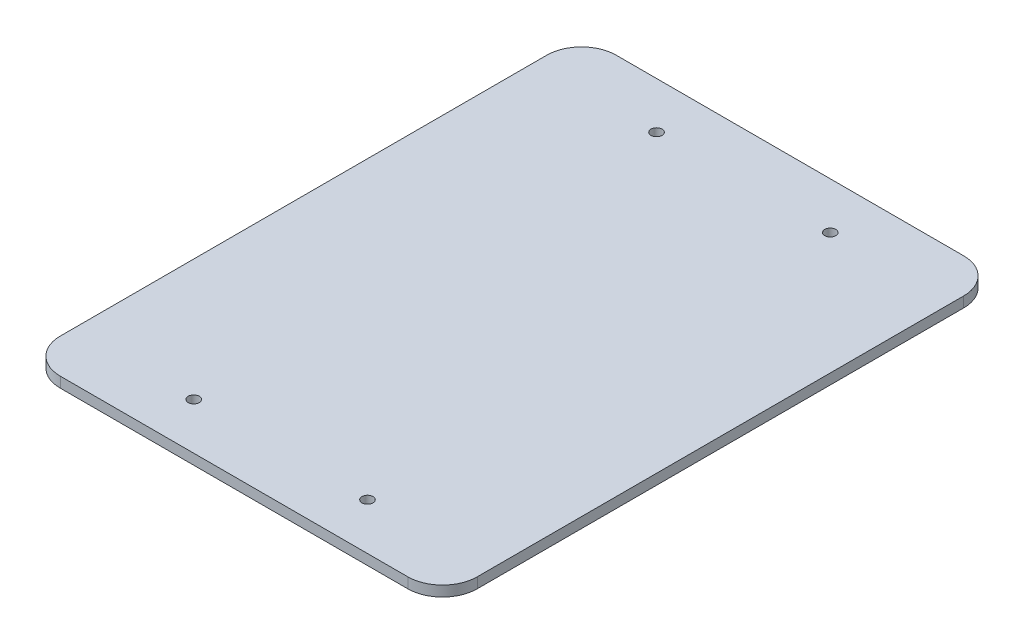
ISO-10303-21;
HEADER;
FILE_DESCRIPTION(('STEP AP214'),'2;1');
FILE_NAME('part.step','',(''),(''),'','','');
FILE_SCHEMA(('AUTOMOTIVE_DESIGN { 1 0 10303 214 1 1 1 1 }'));
ENDSEC;
DATA;
#1=APPLICATION_CONTEXT('core data for automotive mechanical design processes');
#2=APPLICATION_PROTOCOL_DEFINITION('international standard','automotive_design',2000,#1);
#3=PRODUCT_CONTEXT('',#1,'mechanical');
#4=PRODUCT('Part','Part','',(#3));
#5=PRODUCT_RELATED_PRODUCT_CATEGORY('part','',(#4));
#6=PRODUCT_DEFINITION_FORMATION('','',#4);
#7=PRODUCT_DEFINITION_CONTEXT('part definition',#1,'design');
#8=PRODUCT_DEFINITION('design','',#6,#7);
#9=PRODUCT_DEFINITION_SHAPE('','',#8);
#10=(LENGTH_UNIT() NAMED_UNIT(*) SI_UNIT(.MILLI.,.METRE.));
#11=(NAMED_UNIT(*) PLANE_ANGLE_UNIT() SI_UNIT($,.RADIAN.));
#12=(NAMED_UNIT(*) SI_UNIT($,.STERADIAN.) SOLID_ANGLE_UNIT());
#13=UNCERTAINTY_MEASURE_WITH_UNIT(LENGTH_MEASURE(1.E-05),#10,'distance_accuracy_value','');
#14=(GEOMETRIC_REPRESENTATION_CONTEXT(3) GLOBAL_UNCERTAINTY_ASSIGNED_CONTEXT((#13)) GLOBAL_UNIT_ASSIGNED_CONTEXT((#10,
#11,#12)) REPRESENTATION_CONTEXT('',''));
#15=CARTESIAN_POINT('',(0.,0.,0.));
#16=DIRECTION('',(0.,0.,1.));
#17=DIRECTION('',(1.,0.,0.));
#18=AXIS2_PLACEMENT_3D('',#15,#16,#17);
#19=CARTESIAN_POINT('',(110.,3.,-10.));
#20=DIRECTION('',(0.,-1.,0.));
#21=DIRECTION('',(0.,0.,-1.));
#22=AXIS2_PLACEMENT_3D('',#19,#20,#21);
#23=CYLINDRICAL_SURFACE('',#22,10.);
#24=CARTESIAN_POINT('',(110.,0.,-10.));
#25=DIRECTION('',(0.,1.,0.));
#26=DIRECTION('',(0.,0.,1.));
#27=AXIS2_PLACEMENT_3D('',#24,#25,#26);
#28=CIRCLE('',#27,10.);
#29=CARTESIAN_POINT('',(110.,0.,0.));
#30=VERTEX_POINT('',#29);
#31=CARTESIAN_POINT('',(120.,0.,-10.));
#32=VERTEX_POINT('',#31);
#33=EDGE_CURVE('E134',#30,#32,#28,.T.);
#34=ORIENTED_EDGE('',*,*,#33,.T.);
#35=DIRECTION('',(0.,-1.,0.));
#36=VECTOR('',#35,1.);
#37=CARTESIAN_POINT('',(120.,3.,-10.));
#38=LINE('',#37,#36);
#39=CARTESIAN_POINT('',(120.,3.,-10.));
#40=VERTEX_POINT('',#39);
#41=EDGE_CURVE('E11',#40,#32,#38,.T.);
#42=ORIENTED_EDGE('',*,*,#41,.F.);
#43=CARTESIAN_POINT('',(110.,3.,-10.));
#44=DIRECTION('',(0.,1.,0.));
#45=DIRECTION('',(0.,0.,1.));
#46=AXIS2_PLACEMENT_3D('',#43,#44,#45);
#47=CIRCLE('',#46,10.);
#48=CARTESIAN_POINT('',(110.,3.,0.));
#49=VERTEX_POINT('',#48);
#50=EDGE_CURVE('E148',#49,#40,#47,.T.);
#51=ORIENTED_EDGE('',*,*,#50,.F.);
#52=DIRECTION('',(0.,-1.,0.));
#53=VECTOR('',#52,1.);
#54=CARTESIAN_POINT('',(110.,3.,0.));
#55=LINE('',#54,#53);
#56=EDGE_CURVE('E130',#49,#30,#55,.T.);
#57=ORIENTED_EDGE('',*,*,#56,.T.);
#58=EDGE_LOOP('',(#34,#42,#51,#57));
#59=FACE_BOUND('',#58,.T.);
#60=ADVANCED_FACE('F36',(#59),#23,.T.);
#61=CARTESIAN_POINT('',(120.,3.,-10.));
#62=DIRECTION('',(-1.,0.,0.));
#63=DIRECTION('',(0.,0.,1.));
#64=AXIS2_PLACEMENT_3D('',#61,#62,#63);
#65=PLANE('',#64);
#66=DIRECTION('',(0.,0.,-1.));
#67=VECTOR('',#66,1.);
#68=CARTESIAN_POINT('',(120.,0.,-10.));
#69=LINE('',#68,#67);
#70=CARTESIAN_POINT('',(120.,0.,-150.));
#71=VERTEX_POINT('',#70);
#72=EDGE_CURVE('E137',#32,#71,#69,.T.);
#73=ORIENTED_EDGE('',*,*,#72,.T.);
#74=DIRECTION('',(0.,-1.,0.));
#75=VECTOR('',#74,1.);
#76=CARTESIAN_POINT('',(120.,3.,-150.));
#77=LINE('',#76,#75);
#78=CARTESIAN_POINT('',(120.,3.,-150.));
#79=VERTEX_POINT('',#78);
#80=EDGE_CURVE('E45',#79,#71,#77,.T.);
#81=ORIENTED_EDGE('',*,*,#80,.F.);
#82=DIRECTION('',(0.,0.,-1.));
#83=VECTOR('',#82,1.);
#84=CARTESIAN_POINT('',(120.,3.,-10.));
#85=LINE('',#84,#83);
#86=EDGE_CURVE('E97',#40,#79,#85,.T.);
#87=ORIENTED_EDGE('',*,*,#86,.F.);
#88=ORIENTED_EDGE('',*,*,#41,.T.);
#89=EDGE_LOOP('',(#73,#81,#87,#88));
#90=FACE_BOUND('',#89,.T.);
#91=ADVANCED_FACE('F189',(#90),#65,.F.);
#92=CARTESIAN_POINT('',(110.,3.,-150.));
#93=DIRECTION('',(0.,-1.,0.));
#94=DIRECTION('',(0.,0.,-1.));
#95=AXIS2_PLACEMENT_3D('',#92,#93,#94);
#96=CYLINDRICAL_SURFACE('',#95,10.);
#97=CARTESIAN_POINT('',(110.,0.,-150.));
#98=DIRECTION('',(0.,1.,0.));
#99=DIRECTION('',(0.,0.,-1.));
#100=AXIS2_PLACEMENT_3D('',#97,#98,#99);
#101=CIRCLE('',#100,10.);
#102=CARTESIAN_POINT('',(110.,0.,-160.));
#103=VERTEX_POINT('',#102);
#104=EDGE_CURVE('E139',#71,#103,#101,.T.);
#105=ORIENTED_EDGE('',*,*,#104,.T.);
#106=DIRECTION('',(0.,-1.,0.));
#107=VECTOR('',#106,1.);
#108=CARTESIAN_POINT('',(110.,3.,-160.));
#109=LINE('',#108,#107);
#110=CARTESIAN_POINT('',(110.,3.,-160.));
#111=VERTEX_POINT('',#110);
#112=EDGE_CURVE('E155',#111,#103,#109,.T.);
#113=ORIENTED_EDGE('',*,*,#112,.F.);
#114=CARTESIAN_POINT('',(110.,3.,-150.));
#115=DIRECTION('',(0.,1.,0.));
#116=DIRECTION('',(0.,0.,-1.));
#117=AXIS2_PLACEMENT_3D('',#114,#115,#116);
#118=CIRCLE('',#117,10.);
#119=EDGE_CURVE('E204',#79,#111,#118,.T.);
#120=ORIENTED_EDGE('',*,*,#119,.F.);
#121=ORIENTED_EDGE('',*,*,#80,.T.);
#122=EDGE_LOOP('',(#105,#113,#120,#121));
#123=FACE_BOUND('',#122,.T.);
#124=ADVANCED_FACE('F194',(#123),#96,.T.);
#125=CARTESIAN_POINT('',(10.,3.,-160.));
#126=DIRECTION('',(0.,0.,1.));
#127=DIRECTION('',(1.,0.,0.));
#128=AXIS2_PLACEMENT_3D('',#125,#126,#127);
#129=PLANE('',#128);
#130=DIRECTION('',(-1.,0.,0.));
#131=VECTOR('',#130,1.);
#132=CARTESIAN_POINT('',(10.,0.,-160.));
#133=LINE('',#132,#131);
#134=CARTESIAN_POINT('',(10.,0.,-160.));
#135=VERTEX_POINT('',#134);
#136=EDGE_CURVE('E141',#103,#135,#133,.T.);
#137=ORIENTED_EDGE('',*,*,#136,.T.);
#138=DIRECTION('',(0.,-1.,0.));
#139=VECTOR('',#138,1.);
#140=CARTESIAN_POINT('',(10.,3.,-160.));
#141=LINE('',#140,#139);
#142=CARTESIAN_POINT('',(10.,3.,-160.));
#143=VERTEX_POINT('',#142);
#144=EDGE_CURVE('E152',#143,#135,#141,.T.);
#145=ORIENTED_EDGE('',*,*,#144,.F.);
#146=DIRECTION('',(-1.,0.,0.));
#147=VECTOR('',#146,1.);
#148=CARTESIAN_POINT('',(10.,3.,-160.));
#149=LINE('',#148,#147);
#150=EDGE_CURVE('E206',#111,#143,#149,.T.);
#151=ORIENTED_EDGE('',*,*,#150,.F.);
#152=ORIENTED_EDGE('',*,*,#112,.T.);
#153=EDGE_LOOP('',(#137,#145,#151,#152));
#154=FACE_BOUND('',#153,.T.);
#155=ADVANCED_FACE('F253',(#154),#129,.F.);
#156=CARTESIAN_POINT('',(10.,3.,-150.));
#157=DIRECTION('',(0.,-1.,0.));
#158=DIRECTION('',(0.,0.,-1.));
#159=AXIS2_PLACEMENT_3D('',#156,#157,#158);
#160=CYLINDRICAL_SURFACE('',#159,10.);
#161=CARTESIAN_POINT('',(10.,0.,-150.));
#162=DIRECTION('',(0.,1.,0.));
#163=DIRECTION('',(0.,0.,-1.));
#164=AXIS2_PLACEMENT_3D('',#161,#162,#163);
#165=CIRCLE('',#164,10.);
#166=CARTESIAN_POINT('',(0.,0.,-150.));
#167=VERTEX_POINT('',#166);
#168=EDGE_CURVE('E143',#135,#167,#165,.T.);
#169=ORIENTED_EDGE('',*,*,#168,.T.);
#170=DIRECTION('',(0.,-1.,0.));
#171=VECTOR('',#170,1.);
#172=CARTESIAN_POINT('',(0.,3.,-150.));
#173=LINE('',#172,#171);
#174=CARTESIAN_POINT('',(0.,3.,-150.));
#175=VERTEX_POINT('',#174);
#176=EDGE_CURVE('E125',#175,#167,#173,.T.);
#177=ORIENTED_EDGE('',*,*,#176,.F.);
#178=CARTESIAN_POINT('',(10.,3.,-150.));
#179=DIRECTION('',(0.,1.,0.));
#180=DIRECTION('',(0.,0.,-1.));
#181=AXIS2_PLACEMENT_3D('',#178,#179,#180);
#182=CIRCLE('',#181,10.);
#183=EDGE_CURVE('E116',#143,#175,#182,.T.);
#184=ORIENTED_EDGE('',*,*,#183,.F.);
#185=ORIENTED_EDGE('',*,*,#144,.T.);
#186=EDGE_LOOP('',(#169,#177,#184,#185));
#187=FACE_BOUND('',#186,.T.);
#188=ADVANCED_FACE('F250',(#187),#160,.T.);
#189=CARTESIAN_POINT('',(0.,3.,-10.0000000000001));
#190=DIRECTION('',(1.,0.,0.));
#191=DIRECTION('',(0.,0.,-1.));
#192=AXIS2_PLACEMENT_3D('',#189,#190,#191);
#193=PLANE('',#192);
#194=DIRECTION('',(0.,0.,1.));
#195=VECTOR('',#194,1.);
#196=CARTESIAN_POINT('',(0.,0.,-10.0000000000001));
#197=LINE('',#196,#195);
#198=CARTESIAN_POINT('',(0.,0.,-10.0000000000001));
#199=VERTEX_POINT('',#198);
#200=EDGE_CURVE('E124',#167,#199,#197,.T.);
#201=ORIENTED_EDGE('',*,*,#200,.T.);
#202=DIRECTION('',(0.,-1.,0.));
#203=VECTOR('',#202,1.);
#204=CARTESIAN_POINT('',(0.,3.,-10.0000000000001));
#205=LINE('',#204,#203);
#206=CARTESIAN_POINT('',(0.,3.,-10.0000000000001));
#207=VERTEX_POINT('',#206);
#208=EDGE_CURVE('E121',#207,#199,#205,.T.);
#209=ORIENTED_EDGE('',*,*,#208,.F.);
#210=DIRECTION('',(0.,0.,1.));
#211=VECTOR('',#210,1.);
#212=CARTESIAN_POINT('',(0.,3.,-10.0000000000001));
#213=LINE('',#212,#211);
#214=EDGE_CURVE('E110',#175,#207,#213,.T.);
#215=ORIENTED_EDGE('',*,*,#214,.F.);
#216=ORIENTED_EDGE('',*,*,#176,.T.);
#217=EDGE_LOOP('',(#201,#209,#215,#216));
#218=FACE_BOUND('',#217,.T.);
#219=ADVANCED_FACE('F122',(#218),#193,.F.);
#220=CARTESIAN_POINT('',(10.,3.,-10.));
#221=DIRECTION('',(0.,-1.,0.));
#222=DIRECTION('',(0.,0.,-1.));
#223=AXIS2_PLACEMENT_3D('',#220,#221,#222);
#224=CYLINDRICAL_SURFACE('',#223,10.);
#225=CARTESIAN_POINT('',(10.,0.,-10.));
#226=DIRECTION('',(0.,1.,0.));
#227=DIRECTION('',(0.,0.,-1.));
#228=AXIS2_PLACEMENT_3D('',#225,#226,#227);
#229=CIRCLE('',#228,10.);
#230=CARTESIAN_POINT('',(10.0000000000001,0.,0.));
#231=VERTEX_POINT('',#230);
#232=EDGE_CURVE('E83',#199,#231,#229,.T.);
#233=ORIENTED_EDGE('',*,*,#232,.T.);
#234=DIRECTION('',(0.,-1.,0.));
#235=VECTOR('',#234,1.);
#236=CARTESIAN_POINT('',(10.0000000000001,3.,0.));
#237=LINE('',#236,#235);
#238=CARTESIAN_POINT('',(10.0000000000001,3.,0.));
#239=VERTEX_POINT('',#238);
#240=EDGE_CURVE('E126',#239,#231,#237,.T.);
#241=ORIENTED_EDGE('',*,*,#240,.F.);
#242=CARTESIAN_POINT('',(10.,3.,-10.));
#243=DIRECTION('',(0.,1.,0.));
#244=DIRECTION('',(0.,0.,-1.));
#245=AXIS2_PLACEMENT_3D('',#242,#243,#244);
#246=CIRCLE('',#245,10.);
#247=EDGE_CURVE('E114',#207,#239,#246,.T.);
#248=ORIENTED_EDGE('',*,*,#247,.F.);
#249=ORIENTED_EDGE('',*,*,#208,.T.);
#250=EDGE_LOOP('',(#233,#241,#248,#249));
#251=FACE_BOUND('',#250,.T.);
#252=ADVANCED_FACE('F128',(#251),#224,.T.);
#253=CARTESIAN_POINT('',(10.0000000000001,3.,0.));
#254=DIRECTION('',(0.,0.,-1.));
#255=DIRECTION('',(-1.,0.,0.));
#256=AXIS2_PLACEMENT_3D('',#253,#254,#255);
#257=PLANE('',#256);
#258=DIRECTION('',(1.,0.,0.));
#259=VECTOR('',#258,1.);
#260=CARTESIAN_POINT('',(10.0000000000001,0.,0.));
#261=LINE('',#260,#259);
#262=EDGE_CURVE('E89',#231,#30,#261,.T.);
#263=ORIENTED_EDGE('',*,*,#262,.T.);
#264=ORIENTED_EDGE('',*,*,#56,.F.);
#265=DIRECTION('',(1.,0.,0.));
#266=VECTOR('',#265,1.);
#267=CARTESIAN_POINT('',(10.0000000000001,3.,0.));
#268=LINE('',#267,#266);
#269=EDGE_CURVE('E54',#239,#49,#268,.T.);
#270=ORIENTED_EDGE('',*,*,#269,.F.);
#271=ORIENTED_EDGE('',*,*,#240,.T.);
#272=EDGE_LOOP('',(#263,#264,#270,#271));
#273=FACE_BOUND('',#272,.T.);
#274=ADVANCED_FACE('F227',(#273),#257,.F.);
#275=CARTESIAN_POINT('',(110.,3.,-10.));
#276=DIRECTION('',(0.,1.,0.));
#277=DIRECTION('',(0.,0.,1.));
#278=AXIS2_PLACEMENT_3D('',#275,#276,#277);
#279=PLANE('',#278);
#280=CARTESIAN_POINT('',(85.,3.,-146.59));
#281=DIRECTION('',(0.,1.,0.));
#282=DIRECTION('',(0.,0.,1.));
#283=AXIS2_PLACEMENT_3D('',#280,#281,#282);
#284=CIRCLE('',#283,1.58749999999999);
#285=CARTESIAN_POINT('',(85.,3.,-145.0025));
#286=VERTEX_POINT('',#285);
#287=EDGE_CURVE('E214',#286,#286,#284,.T.);
#288=ORIENTED_EDGE('',*,*,#287,.F.);
#289=EDGE_LOOP('',(#288));
#290=FACE_BOUND('',#289,.T.);
#291=CARTESIAN_POINT('',(35.,3.,-13.41));
#292=DIRECTION('',(0.,1.,0.));
#293=DIRECTION('',(0.,0.,1.));
#294=AXIS2_PLACEMENT_3D('',#291,#292,#293);
#295=CIRCLE('',#294,1.5875);
#296=CARTESIAN_POINT('',(35.,3.,-11.8225));
#297=VERTEX_POINT('',#296);
#298=EDGE_CURVE('E215',#297,#297,#295,.T.);
#299=ORIENTED_EDGE('',*,*,#298,.F.);
#300=EDGE_LOOP('',(#299));
#301=FACE_BOUND('',#300,.T.);
#302=CARTESIAN_POINT('',(85.,3.,-13.41));
#303=DIRECTION('',(0.,1.,0.));
#304=DIRECTION('',(0.,0.,1.));
#305=AXIS2_PLACEMENT_3D('',#302,#303,#304);
#306=CIRCLE('',#305,1.5875);
#307=CARTESIAN_POINT('',(85.,3.,-11.8225));
#308=VERTEX_POINT('',#307);
#309=EDGE_CURVE('E218',#308,#308,#306,.T.);
#310=ORIENTED_EDGE('',*,*,#309,.F.);
#311=EDGE_LOOP('',(#310));
#312=FACE_BOUND('',#311,.T.);
#313=CARTESIAN_POINT('',(35.,3.,-146.59));
#314=DIRECTION('',(0.,1.,0.));
#315=DIRECTION('',(0.,0.,1.));
#316=AXIS2_PLACEMENT_3D('',#313,#314,#315);
#317=CIRCLE('',#316,1.5875);
#318=CARTESIAN_POINT('',(35.,3.,-145.0025));
#319=VERTEX_POINT('',#318);
#320=EDGE_CURVE('E164',#319,#319,#317,.T.);
#321=ORIENTED_EDGE('',*,*,#320,.F.);
#322=EDGE_LOOP('',(#321));
#323=FACE_BOUND('',#322,.T.);
#324=ORIENTED_EDGE('',*,*,#50,.T.);
#325=ORIENTED_EDGE('',*,*,#86,.T.);
#326=ORIENTED_EDGE('',*,*,#119,.T.);
#327=ORIENTED_EDGE('',*,*,#150,.T.);
#328=ORIENTED_EDGE('',*,*,#183,.T.);
#329=ORIENTED_EDGE('',*,*,#214,.T.);
#330=ORIENTED_EDGE('',*,*,#247,.T.);
#331=ORIENTED_EDGE('',*,*,#269,.T.);
#332=EDGE_LOOP('',(#324,#325,#326,#327,#328,#329,#330,#331));
#333=FACE_BOUND('',#332,.T.);
#334=ADVANCED_FACE('F112',(#290,#301,#312,#323,#333),#279,.T.);
#335=CARTESIAN_POINT('',(110.,0.,-10.));
#336=DIRECTION('',(0.,1.,0.));
#337=DIRECTION('',(0.,0.,1.));
#338=AXIS2_PLACEMENT_3D('',#335,#336,#337);
#339=PLANE('',#338);
#340=CARTESIAN_POINT('',(85.,0.,-146.59));
#341=DIRECTION('',(0.,1.,0.));
#342=DIRECTION('',(0.,0.,1.));
#343=AXIS2_PLACEMENT_3D('',#340,#341,#342);
#344=CIRCLE('',#343,1.58749999999999);
#345=CARTESIAN_POINT('',(85.,0.,-145.0025));
#346=VERTEX_POINT('',#345);
#347=EDGE_CURVE('E39',#346,#346,#344,.T.);
#348=ORIENTED_EDGE('',*,*,#347,.T.);
#349=EDGE_LOOP('',(#348));
#350=FACE_BOUND('',#349,.T.);
#351=CARTESIAN_POINT('',(35.,0.,-13.41));
#352=DIRECTION('',(0.,1.,0.));
#353=DIRECTION('',(0.,0.,1.));
#354=AXIS2_PLACEMENT_3D('',#351,#352,#353);
#355=CIRCLE('',#354,1.5875);
#356=CARTESIAN_POINT('',(35.,0.,-11.8225));
#357=VERTEX_POINT('',#356);
#358=EDGE_CURVE('E166',#357,#357,#355,.T.);
#359=ORIENTED_EDGE('',*,*,#358,.T.);
#360=EDGE_LOOP('',(#359));
#361=FACE_BOUND('',#360,.T.);
#362=CARTESIAN_POINT('',(85.,0.,-13.41));
#363=DIRECTION('',(0.,1.,0.));
#364=DIRECTION('',(0.,0.,1.));
#365=AXIS2_PLACEMENT_3D('',#362,#363,#364);
#366=CIRCLE('',#365,1.5875);
#367=CARTESIAN_POINT('',(85.,0.,-11.8225));
#368=VERTEX_POINT('',#367);
#369=EDGE_CURVE('E163',#368,#368,#366,.T.);
#370=ORIENTED_EDGE('',*,*,#369,.T.);
#371=EDGE_LOOP('',(#370));
#372=FACE_BOUND('',#371,.T.);
#373=CARTESIAN_POINT('',(35.,0.,-146.59));
#374=DIRECTION('',(0.,1.,0.));
#375=DIRECTION('',(0.,0.,1.));
#376=AXIS2_PLACEMENT_3D('',#373,#374,#375);
#377=CIRCLE('',#376,1.5875);
#378=CARTESIAN_POINT('',(35.,0.,-145.0025));
#379=VERTEX_POINT('',#378);
#380=EDGE_CURVE('E160',#379,#379,#377,.T.);
#381=ORIENTED_EDGE('',*,*,#380,.T.);
#382=EDGE_LOOP('',(#381));
#383=FACE_BOUND('',#382,.T.);
#384=ORIENTED_EDGE('',*,*,#33,.F.);
#385=ORIENTED_EDGE('',*,*,#262,.F.);
#386=ORIENTED_EDGE('',*,*,#232,.F.);
#387=ORIENTED_EDGE('',*,*,#200,.F.);
#388=ORIENTED_EDGE('',*,*,#168,.F.);
#389=ORIENTED_EDGE('',*,*,#136,.F.);
#390=ORIENTED_EDGE('',*,*,#104,.F.);
#391=ORIENTED_EDGE('',*,*,#72,.F.);
#392=EDGE_LOOP('',(#384,#385,#386,#387,#388,#389,#390,#391));
#393=FACE_BOUND('',#392,.T.);
#394=ADVANCED_FACE('F173',(#350,#361,#372,#383,#393),#339,.F.);
#395=CARTESIAN_POINT('',(35.,-7.,-146.59));
#396=DIRECTION('',(0.,1.,0.));
#397=DIRECTION('',(0.,0.,1.));
#398=AXIS2_PLACEMENT_3D('',#395,#396,#397);
#399=CYLINDRICAL_SURFACE('',#398,1.5875);
#400=ORIENTED_EDGE('',*,*,#320,.T.);
#401=EDGE_LOOP('',(#400));
#402=FACE_BOUND('',#401,.T.);
#403=ORIENTED_EDGE('',*,*,#380,.F.);
#404=EDGE_LOOP('',(#403));
#405=FACE_BOUND('',#404,.T.);
#406=ADVANCED_FACE('F232',(#402,#405),#399,.F.);
#407=CARTESIAN_POINT('',(85.,-7.,-13.41));
#408=DIRECTION('',(0.,1.,0.));
#409=DIRECTION('',(0.,0.,1.));
#410=AXIS2_PLACEMENT_3D('',#407,#408,#409);
#411=CYLINDRICAL_SURFACE('',#410,1.5875);
#412=ORIENTED_EDGE('',*,*,#309,.T.);
#413=EDGE_LOOP('',(#412));
#414=FACE_BOUND('',#413,.T.);
#415=ORIENTED_EDGE('',*,*,#369,.F.);
#416=EDGE_LOOP('',(#415));
#417=FACE_BOUND('',#416,.T.);
#418=ADVANCED_FACE('F183',(#414,#417),#411,.F.);
#419=CARTESIAN_POINT('',(35.,-7.,-13.41));
#420=DIRECTION('',(0.,1.,0.));
#421=DIRECTION('',(0.,0.,1.));
#422=AXIS2_PLACEMENT_3D('',#419,#420,#421);
#423=CYLINDRICAL_SURFACE('',#422,1.5875);
#424=ORIENTED_EDGE('',*,*,#298,.T.);
#425=EDGE_LOOP('',(#424));
#426=FACE_BOUND('',#425,.T.);
#427=ORIENTED_EDGE('',*,*,#358,.F.);
#428=EDGE_LOOP('',(#427));
#429=FACE_BOUND('',#428,.T.);
#430=ADVANCED_FACE('F177',(#426,#429),#423,.F.);
#431=CARTESIAN_POINT('',(85.,-7.,-146.59));
#432=DIRECTION('',(0.,1.,0.));
#433=DIRECTION('',(0.,0.,1.));
#434=AXIS2_PLACEMENT_3D('',#431,#432,#433);
#435=CYLINDRICAL_SURFACE('',#434,1.58749999999999);
#436=ORIENTED_EDGE('',*,*,#287,.T.);
#437=EDGE_LOOP('',(#436));
#438=FACE_BOUND('',#437,.T.);
#439=ORIENTED_EDGE('',*,*,#347,.F.);
#440=EDGE_LOOP('',(#439));
#441=FACE_BOUND('',#440,.T.);
#442=ADVANCED_FACE('F175',(#438,#441),#435,.F.);
#443=CLOSED_SHELL('',(#60,#91,#124,#155,#188,#219,#252,#274,#334,#394,#406,#418,#430,#442));
#444=MANIFOLD_SOLID_BREP('B2',#443);
#445=ADVANCED_BREP_SHAPE_REPRESENTATION('',(#18,#444),#14);
#446=SHAPE_DEFINITION_REPRESENTATION(#9,#445);
ENDSEC;
END-ISO-10303-21;
